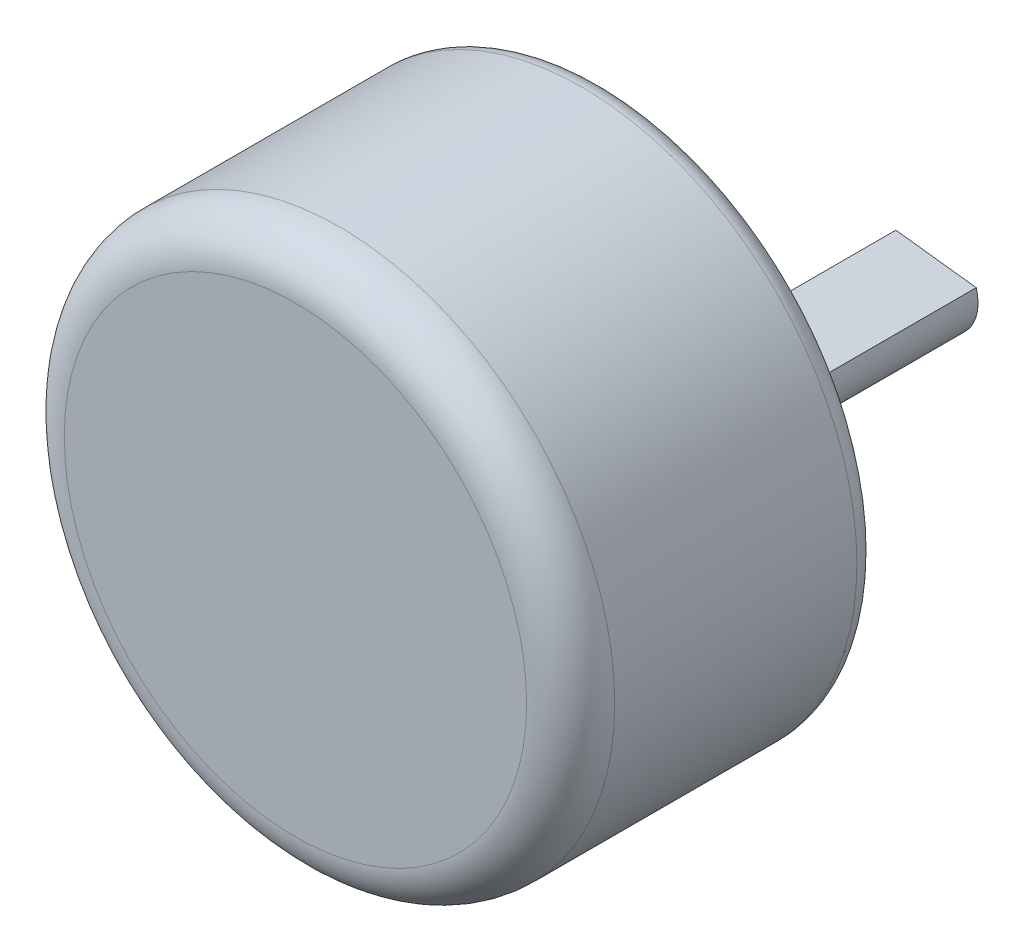
ISO-10303-21;
HEADER;
FILE_DESCRIPTION(('STEP AP214'),'2;1');
FILE_NAME('part.step','',(''),(''),'','','');
FILE_SCHEMA(('AUTOMOTIVE_DESIGN { 1 0 10303 214 1 1 1 1 }'));
ENDSEC;
DATA;
#1=APPLICATION_CONTEXT('core data for automotive mechanical design processes');
#2=APPLICATION_PROTOCOL_DEFINITION('international standard','automotive_design',2000,#1);
#3=PRODUCT_CONTEXT('',#1,'mechanical');
#4=PRODUCT('Part','Part','',(#3));
#5=PRODUCT_RELATED_PRODUCT_CATEGORY('part','',(#4));
#6=PRODUCT_DEFINITION_FORMATION('','',#4);
#7=PRODUCT_DEFINITION_CONTEXT('part definition',#1,'design');
#8=PRODUCT_DEFINITION('design','',#6,#7);
#9=PRODUCT_DEFINITION_SHAPE('','',#8);
#10=(LENGTH_UNIT() NAMED_UNIT(*) SI_UNIT(.MILLI.,.METRE.));
#11=(NAMED_UNIT(*) PLANE_ANGLE_UNIT() SI_UNIT($,.RADIAN.));
#12=(NAMED_UNIT(*) SI_UNIT($,.STERADIAN.) SOLID_ANGLE_UNIT());
#13=UNCERTAINTY_MEASURE_WITH_UNIT(LENGTH_MEASURE(1.E-05),#10,'distance_accuracy_value','');
#14=(GEOMETRIC_REPRESENTATION_CONTEXT(3) GLOBAL_UNCERTAINTY_ASSIGNED_CONTEXT((#13)) GLOBAL_UNIT_ASSIGNED_CONTEXT((#10,
#11,#12)) REPRESENTATION_CONTEXT('',''));
#15=CARTESIAN_POINT('',(0.,0.,0.));
#16=DIRECTION('',(0.,0.,1.));
#17=DIRECTION('',(1.,0.,0.));
#18=AXIS2_PLACEMENT_3D('',#15,#16,#17);
#19=CARTESIAN_POINT('',(0.,0.,14.));
#20=DIRECTION('',(0.,0.,-1.));
#21=DIRECTION('',(-1.,0.,0.));
#22=AXIS2_PLACEMENT_3D('',#19,#20,#21);
#23=CYLINDRICAL_SURFACE('',#22,12.5);
#24=CARTESIAN_POINT('',(0.,0.,12.));
#25=DIRECTION('',(0.,0.,1.));
#26=DIRECTION('',(1.,0.,0.));
#27=AXIS2_PLACEMENT_3D('',#24,#25,#26);
#28=CIRCLE('',#27,12.5);
#29=CARTESIAN_POINT('',(12.5,0.,12.));
#30=VERTEX_POINT('',#29);
#31=EDGE_CURVE('E11',#30,#30,#28,.F.);
#32=ORIENTED_EDGE('',*,*,#31,.T.);
#33=EDGE_LOOP('',(#32));
#34=FACE_BOUND('',#33,.T.);
#35=CARTESIAN_POINT('',(0.,0.,0.999999999999999));
#36=DIRECTION('',(0.,0.,1.));
#37=DIRECTION('',(1.,0.,0.));
#38=AXIS2_PLACEMENT_3D('',#35,#36,#37);
#39=CIRCLE('',#38,12.5);
#40=CARTESIAN_POINT('',(12.5,0.,0.999999999999999));
#41=VERTEX_POINT('',#40);
#42=EDGE_CURVE('E105',#41,#41,#39,.T.);
#43=ORIENTED_EDGE('',*,*,#42,.T.);
#44=EDGE_LOOP('',(#43));
#45=FACE_BOUND('',#44,.T.);
#46=ADVANCED_FACE('F42',(#34,#45),#23,.T.);
#47=CARTESIAN_POINT('',(0.,0.,14.));
#48=DIRECTION('',(0.,0.,1.));
#49=DIRECTION('',(1.,0.,0.));
#50=AXIS2_PLACEMENT_3D('',#47,#48,#49);
#51=PLANE('',#50);
#52=CARTESIAN_POINT('',(0.,0.,14.));
#53=DIRECTION('',(0.,0.,1.));
#54=DIRECTION('',(1.,0.,0.));
#55=AXIS2_PLACEMENT_3D('',#52,#53,#54);
#56=CIRCLE('',#55,10.5);
#57=CARTESIAN_POINT('',(10.5,0.,14.));
#58=VERTEX_POINT('',#57);
#59=EDGE_CURVE('E51',#58,#58,#56,.T.);
#60=ORIENTED_EDGE('',*,*,#59,.T.);
#61=EDGE_LOOP('',(#60));
#62=FACE_BOUND('',#61,.T.);
#63=ADVANCED_FACE('F139',(#62),#51,.T.);
#64=CARTESIAN_POINT('',(0.,0.,0.));
#65=DIRECTION('',(0.,0.,1.));
#66=DIRECTION('',(1.,0.,0.));
#67=AXIS2_PLACEMENT_3D('',#64,#65,#66);
#68=PLANE('',#67);
#69=CARTESIAN_POINT('',(0.,-3.,0.));
#70=DIRECTION('',(0.,0.,1.));
#71=DIRECTION('',(1.,0.,0.));
#72=AXIS2_PLACEMENT_3D('',#69,#70,#71);
#73=CIRCLE('',#72,4.25);
#74=CARTESIAN_POINT('',(4.25,-3.,0.));
#75=VERTEX_POINT('',#74);
#76=EDGE_CURVE('E124',#75,#75,#73,.F.);
#77=ORIENTED_EDGE('',*,*,#76,.F.);
#78=EDGE_LOOP('',(#77));
#79=FACE_BOUND('',#78,.T.);
#80=CARTESIAN_POINT('',(9.49999999999999,0.,0.));
#81=DIRECTION('',(0.,0.,-1.));
#82=DIRECTION('',(-1.,0.,0.));
#83=AXIS2_PLACEMENT_3D('',#80,#81,#82);
#84=CIRCLE('',#83,1.);
#85=CARTESIAN_POINT('',(8.49999999999999,0.,0.));
#86=VERTEX_POINT('',#85);
#87=EDGE_CURVE('E106',#86,#86,#84,.T.);
#88=ORIENTED_EDGE('',*,*,#87,.F.);
#89=EDGE_LOOP('',(#88));
#90=FACE_BOUND('',#89,.T.);
#91=CARTESIAN_POINT('',(-9.5,0.,0.));
#92=DIRECTION('',(0.,0.,-1.));
#93=DIRECTION('',(-1.,0.,0.));
#94=AXIS2_PLACEMENT_3D('',#91,#92,#93);
#95=CIRCLE('',#94,1.);
#96=CARTESIAN_POINT('',(-10.5,0.,0.));
#97=VERTEX_POINT('',#96);
#98=EDGE_CURVE('E110',#97,#97,#95,.T.);
#99=ORIENTED_EDGE('',*,*,#98,.F.);
#100=EDGE_LOOP('',(#99));
#101=FACE_BOUND('',#100,.T.);
#102=CARTESIAN_POINT('',(0.,0.,0.));
#103=DIRECTION('',(0.,0.,1.));
#104=DIRECTION('',(1.,0.,0.));
#105=AXIS2_PLACEMENT_3D('',#102,#103,#104);
#106=CIRCLE('',#105,11.5);
#107=CARTESIAN_POINT('',(11.5,0.,0.));
#108=VERTEX_POINT('',#107);
#109=EDGE_CURVE('E120',#108,#108,#106,.F.);
#110=ORIENTED_EDGE('',*,*,#109,.T.);
#111=EDGE_LOOP('',(#110));
#112=FACE_BOUND('',#111,.T.);
#113=ADVANCED_FACE('F154',(#79,#90,#101,#112),#68,.F.);
#114=CARTESIAN_POINT('',(0.,0.,0.999999999999999));
#115=DIRECTION('',(0.,0.,1.));
#116=DIRECTION('',(1.,0.,0.));
#117=AXIS2_PLACEMENT_3D('',#114,#115,#116);
#118=TOROIDAL_SURFACE('',#117,11.5,1.);
#119=ORIENTED_EDGE('',*,*,#109,.F.);
#120=EDGE_LOOP('',(#119));
#121=FACE_BOUND('',#120,.T.);
#122=ORIENTED_EDGE('',*,*,#42,.F.);
#123=EDGE_LOOP('',(#122));
#124=FACE_BOUND('',#123,.T.);
#125=ADVANCED_FACE('F159',(#121,#124),#118,.T.);
#126=CARTESIAN_POINT('',(-9.5,0.,5.));
#127=DIRECTION('',(0.,0.,-1.));
#128=DIRECTION('',(-1.,0.,0.));
#129=AXIS2_PLACEMENT_3D('',#126,#127,#128);
#130=CYLINDRICAL_SURFACE('',#129,1.);
#131=CARTESIAN_POINT('',(-9.5,0.,5.));
#132=DIRECTION('',(0.,0.,-1.));
#133=DIRECTION('',(-1.,0.,0.));
#134=AXIS2_PLACEMENT_3D('',#131,#132,#133);
#135=CIRCLE('',#134,1.);
#136=CARTESIAN_POINT('',(-10.5,0.,5.));
#137=VERTEX_POINT('',#136);
#138=EDGE_CURVE('E97',#137,#137,#135,.T.);
#139=ORIENTED_EDGE('',*,*,#138,.F.);
#140=EDGE_LOOP('',(#139));
#141=FACE_BOUND('',#140,.T.);
#142=ORIENTED_EDGE('',*,*,#98,.T.);
#143=EDGE_LOOP('',(#142));
#144=FACE_BOUND('',#143,.T.);
#145=ADVANCED_FACE('F161',(#141,#144),#130,.F.);
#146=CARTESIAN_POINT('',(-9.5,0.,5.));
#147=DIRECTION('',(0.,0.,-1.));
#148=DIRECTION('',(-1.,0.,0.));
#149=AXIS2_PLACEMENT_3D('',#146,#147,#148);
#150=PLANE('',#149);
#151=ORIENTED_EDGE('',*,*,#138,.T.);
#152=EDGE_LOOP('',(#151));
#153=FACE_BOUND('',#152,.T.);
#154=ADVANCED_FACE('F198',(#153),#150,.T.);
#155=CARTESIAN_POINT('',(9.49999999999999,0.,5.));
#156=DIRECTION('',(0.,0.,-1.));
#157=DIRECTION('',(-1.,0.,0.));
#158=AXIS2_PLACEMENT_3D('',#155,#156,#157);
#159=CYLINDRICAL_SURFACE('',#158,1.);
#160=CARTESIAN_POINT('',(9.49999999999999,0.,5.));
#161=DIRECTION('',(0.,0.,-1.));
#162=DIRECTION('',(-1.,0.,0.));
#163=AXIS2_PLACEMENT_3D('',#160,#161,#162);
#164=CIRCLE('',#163,1.);
#165=CARTESIAN_POINT('',(8.49999999999999,0.,5.));
#166=VERTEX_POINT('',#165);
#167=EDGE_CURVE('E101',#166,#166,#164,.T.);
#168=ORIENTED_EDGE('',*,*,#167,.F.);
#169=EDGE_LOOP('',(#168));
#170=FACE_BOUND('',#169,.T.);
#171=ORIENTED_EDGE('',*,*,#87,.T.);
#172=EDGE_LOOP('',(#171));
#173=FACE_BOUND('',#172,.T.);
#174=ADVANCED_FACE('F204',(#170,#173),#159,.F.);
#175=CARTESIAN_POINT('',(9.49999999999999,0.,5.));
#176=DIRECTION('',(0.,0.,-1.));
#177=DIRECTION('',(-1.,0.,0.));
#178=AXIS2_PLACEMENT_3D('',#175,#176,#177);
#179=PLANE('',#178);
#180=ORIENTED_EDGE('',*,*,#167,.T.);
#181=EDGE_LOOP('',(#180));
#182=FACE_BOUND('',#181,.T.);
#183=ADVANCED_FACE('F183',(#182),#179,.T.);
#184=CARTESIAN_POINT('',(0.,-3.,-3.));
#185=DIRECTION('',(0.,0.,1.));
#186=DIRECTION('',(1.,0.,0.));
#187=AXIS2_PLACEMENT_3D('',#184,#185,#186);
#188=CYLINDRICAL_SURFACE('',#187,4.25);
#189=CARTESIAN_POINT('',(0.,-3.,-2.5));
#190=DIRECTION('',(0.,0.,-1.));
#191=DIRECTION('',(-1.,0.,0.));
#192=AXIS2_PLACEMENT_3D('',#189,#190,#191);
#193=CIRCLE('',#192,4.25);
#194=CARTESIAN_POINT('',(-4.25,-3.,-2.5));
#195=VERTEX_POINT('',#194);
#196=EDGE_CURVE('E132',#195,#195,#193,.F.);
#197=ORIENTED_EDGE('',*,*,#196,.T.);
#198=EDGE_LOOP('',(#197));
#199=FACE_BOUND('',#198,.T.);
#200=ORIENTED_EDGE('',*,*,#76,.T.);
#201=EDGE_LOOP('',(#200));
#202=FACE_BOUND('',#201,.T.);
#203=ADVANCED_FACE('F173',(#199,#202),#188,.T.);
#204=CARTESIAN_POINT('',(0.,-3.,-3.));
#205=DIRECTION('',(0.,0.,-1.));
#206=DIRECTION('',(-1.,0.,0.));
#207=AXIS2_PLACEMENT_3D('',#204,#205,#206);
#208=PLANE('',#207);
#209=CARTESIAN_POINT('',(0.,-3.,-3.));
#210=DIRECTION('',(0.,0.,-1.));
#211=DIRECTION('',(-1.,0.,0.));
#212=AXIS2_PLACEMENT_3D('',#209,#210,#211);
#213=CIRCLE('',#212,2.);
#214=CARTESIAN_POINT('',(-2.,-3.,-3.));
#215=VERTEX_POINT('',#214);
#216=EDGE_CURVE('E93',#215,#215,#213,.T.);
#217=ORIENTED_EDGE('',*,*,#216,.F.);
#218=EDGE_LOOP('',(#217));
#219=FACE_BOUND('',#218,.T.);
#220=CARTESIAN_POINT('',(0.,-3.,-3.));
#221=DIRECTION('',(0.,0.,-1.));
#222=DIRECTION('',(-1.,0.,0.));
#223=AXIS2_PLACEMENT_3D('',#220,#221,#222);
#224=CIRCLE('',#223,3.75);
#225=CARTESIAN_POINT('',(-3.75,-3.,-3.));
#226=VERTEX_POINT('',#225);
#227=EDGE_CURVE('E128',#226,#226,#224,.T.);
#228=ORIENTED_EDGE('',*,*,#227,.T.);
#229=EDGE_LOOP('',(#228));
#230=FACE_BOUND('',#229,.T.);
#231=ADVANCED_FACE('F165',(#219,#230),#208,.T.);
#232=CARTESIAN_POINT('',(0.,-3.,-2.5));
#233=DIRECTION('',(0.,0.,-1.));
#234=DIRECTION('',(-1.,0.,0.));
#235=AXIS2_PLACEMENT_3D('',#232,#233,#234);
#236=TOROIDAL_SURFACE('',#235,3.75,0.5);
#237=ORIENTED_EDGE('',*,*,#196,.F.);
#238=EDGE_LOOP('',(#237));
#239=FACE_BOUND('',#238,.T.);
#240=ORIENTED_EDGE('',*,*,#227,.F.);
#241=EDGE_LOOP('',(#240));
#242=FACE_BOUND('',#241,.T.);
#243=ADVANCED_FACE('F163',(#239,#242),#236,.T.);
#244=CARTESIAN_POINT('',(0.,-3.,-15.));
#245=DIRECTION('',(0.,0.,1.));
#246=DIRECTION('',(1.,0.,0.));
#247=AXIS2_PLACEMENT_3D('',#244,#245,#246);
#248=CYLINDRICAL_SURFACE('',#247,2.);
#249=CARTESIAN_POINT('',(0.,-3.,-15.));
#250=DIRECTION('',(0.,0.,-1.));
#251=DIRECTION('',(-1.,0.,0.));
#252=AXIS2_PLACEMENT_3D('',#249,#250,#251);
#253=CIRCLE('',#252,2.);
#254=CARTESIAN_POINT('',(1.91906623518634,-2.4368083940898,-15.));
#255=VERTEX_POINT('',#254);
#256=CARTESIAN_POINT('',(-1.73196335624444,-1.99984854515604,-15.));
#257=VERTEX_POINT('',#256);
#258=EDGE_CURVE('E74',#255,#257,#253,.T.);
#259=ORIENTED_EDGE('',*,*,#258,.F.);
#260=DIRECTION('',(0.,0.,1.));
#261=VECTOR('',#260,1.);
#262=CARTESIAN_POINT('',(1.91906623518634,-2.4368083940898,-92.1593168258684));
#263=LINE('',#262,#261);
#264=CARTESIAN_POINT('',(1.91906623518634,-2.4368083940898,-6.));
#265=VERTEX_POINT('',#264);
#266=EDGE_CURVE('E71',#255,#265,#263,.T.);
#267=ORIENTED_EDGE('',*,*,#266,.T.);
#268=CARTESIAN_POINT('',(0.,-3.,-6.));
#269=DIRECTION('',(0.,0.,-1.));
#270=DIRECTION('',(-1.,0.,0.));
#271=AXIS2_PLACEMENT_3D('',#268,#269,#270);
#272=CIRCLE('',#271,2.);
#273=CARTESIAN_POINT('',(-1.73196335624444,-1.99984854515604,-6.));
#274=VERTEX_POINT('',#273);
#275=EDGE_CURVE('E58',#274,#265,#272,.T.);
#276=ORIENTED_EDGE('',*,*,#275,.F.);
#277=DIRECTION('',(0.,0.,1.));
#278=VECTOR('',#277,1.);
#279=CARTESIAN_POINT('',(-1.73196335624444,-1.99984854515604,-92.1593168258684));
#280=LINE('',#279,#278);
#281=EDGE_CURVE('E78',#257,#274,#280,.T.);
#282=ORIENTED_EDGE('',*,*,#281,.F.);
#283=EDGE_LOOP('',(#259,#267,#276,#282));
#284=FACE_BOUND('',#283,.T.);
#285=ORIENTED_EDGE('',*,*,#216,.T.);
#286=EDGE_LOOP('',(#285));
#287=FACE_BOUND('',#286,.T.);
#288=ADVANCED_FACE('F72',(#284,#287),#248,.T.);
#289=CARTESIAN_POINT('',(0.,-3.,-15.));
#290=DIRECTION('',(0.,0.,-1.));
#291=DIRECTION('',(-1.,0.,0.));
#292=AXIS2_PLACEMENT_3D('',#289,#290,#291);
#293=PLANE('',#292);
#294=DIRECTION('',(-0.992914227259568,0.118833233169578,0.));
#295=VECTOR('',#294,1.);
#296=CARTESIAN_POINT('',(1.91906623518634,-2.4368083940898,-15.));
#297=LINE('',#296,#295);
#298=EDGE_CURVE('E65',#255,#257,#297,.T.);
#299=ORIENTED_EDGE('',*,*,#298,.F.);
#300=ORIENTED_EDGE('',*,*,#258,.T.);
#301=EDGE_LOOP('',(#299,#300));
#302=FACE_BOUND('',#301,.T.);
#303=ADVANCED_FACE('F171',(#302),#293,.T.);
#304=CARTESIAN_POINT('',(1.91906623518634,-2.4368083940898,-92.1593168258684));
#305=DIRECTION('',(0.118833233169578,0.992914227259568,0.));
#306=DIRECTION('',(-0.992914227259568,0.118833233169578,0.));
#307=AXIS2_PLACEMENT_3D('',#304,#305,#306);
#308=PLANE('',#307);
#309=ORIENTED_EDGE('',*,*,#266,.F.);
#310=ORIENTED_EDGE('',*,*,#298,.T.);
#311=ORIENTED_EDGE('',*,*,#281,.T.);
#312=DIRECTION('',(-0.992914227259568,0.118833233169578,0.));
#313=VECTOR('',#312,1.);
#314=CARTESIAN_POINT('',(1.91906623518634,-2.4368083940898,-6.00000000000001));
#315=LINE('',#314,#313);
#316=EDGE_CURVE('E82',#265,#274,#315,.T.);
#317=ORIENTED_EDGE('',*,*,#316,.F.);
#318=EDGE_LOOP('',(#309,#310,#311,#317));
#319=FACE_BOUND('',#318,.T.);
#320=ADVANCED_FACE('F86',(#319),#308,.T.);
#321=CARTESIAN_POINT('',(0.,-3.,-6.));
#322=DIRECTION('',(0.,0.,-1.));
#323=DIRECTION('',(-1.,0.,0.));
#324=AXIS2_PLACEMENT_3D('',#321,#322,#323);
#325=PLANE('',#324);
#326=ORIENTED_EDGE('',*,*,#316,.T.);
#327=ORIENTED_EDGE('',*,*,#275,.T.);
#328=EDGE_LOOP('',(#326,#327));
#329=FACE_BOUND('',#328,.T.);
#330=ADVANCED_FACE('F81',(#329),#325,.T.);
#331=CARTESIAN_POINT('',(0.,0.,12.));
#332=DIRECTION('',(0.,0.,1.));
#333=DIRECTION('',(1.,0.,0.));
#334=AXIS2_PLACEMENT_3D('',#331,#332,#333);
#335=TOROIDAL_SURFACE('',#334,10.5,2.);
#336=ORIENTED_EDGE('',*,*,#31,.F.);
#337=EDGE_LOOP('',(#336));
#338=FACE_BOUND('',#337,.T.);
#339=ORIENTED_EDGE('',*,*,#59,.F.);
#340=EDGE_LOOP('',(#339));
#341=FACE_BOUND('',#340,.T.);
#342=ADVANCED_FACE('F44',(#338,#341),#335,.T.);
#343=CLOSED_SHELL('',(#46,#63,#113,#125,#145,#154,#174,#183,#203,#231,#243,#288,#303,#320,#330,#342));
#344=MANIFOLD_SOLID_BREP('B2',#343);
#345=ADVANCED_BREP_SHAPE_REPRESENTATION('',(#18,#344),#14);
#346=SHAPE_DEFINITION_REPRESENTATION(#9,#345);
ENDSEC;
END-ISO-10303-21;
